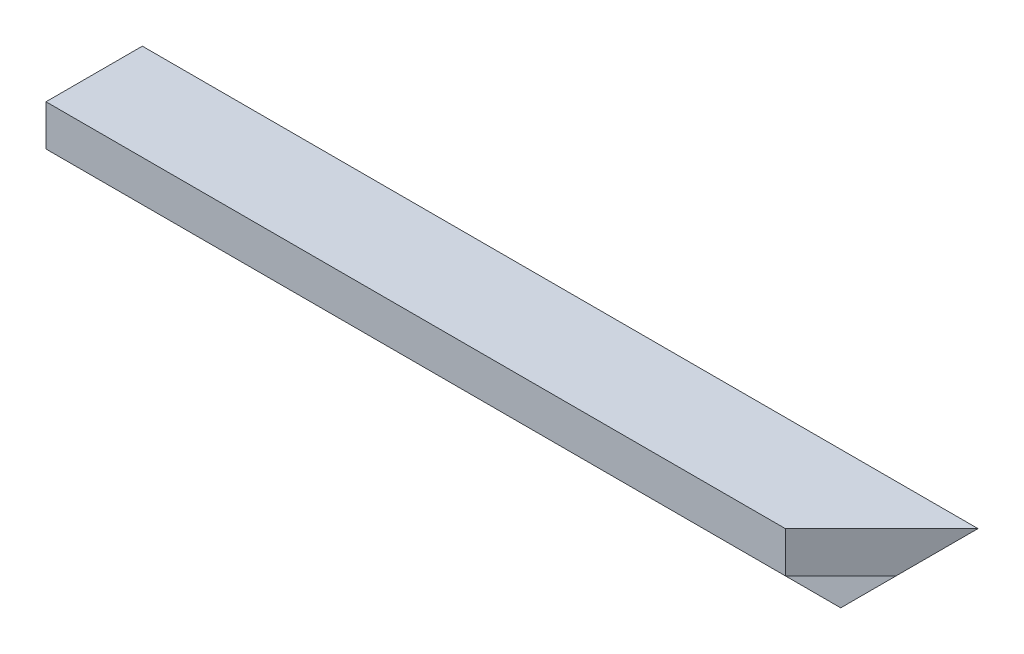
ISO-10303-21;
HEADER;
FILE_DESCRIPTION(('STEP AP214'),'2;1');
FILE_NAME('part.step','',(''),(''),'','','');
FILE_SCHEMA(('AUTOMOTIVE_DESIGN { 1 0 10303 214 1 1 1 1 }'));
ENDSEC;
DATA;
#1=APPLICATION_CONTEXT('core data for automotive mechanical design processes');
#2=APPLICATION_PROTOCOL_DEFINITION('international standard','automotive_design',2000,#1);
#3=PRODUCT_CONTEXT('',#1,'mechanical');
#4=PRODUCT('Part','Part','',(#3));
#5=PRODUCT_RELATED_PRODUCT_CATEGORY('part','',(#4));
#6=PRODUCT_DEFINITION_FORMATION('','',#4);
#7=PRODUCT_DEFINITION_CONTEXT('part definition',#1,'design');
#8=PRODUCT_DEFINITION('design','',#6,#7);
#9=PRODUCT_DEFINITION_SHAPE('','',#8);
#10=(LENGTH_UNIT() NAMED_UNIT(*) SI_UNIT(.MILLI.,.METRE.));
#11=(NAMED_UNIT(*) PLANE_ANGLE_UNIT() SI_UNIT($,.RADIAN.));
#12=(NAMED_UNIT(*) SI_UNIT($,.STERADIAN.) SOLID_ANGLE_UNIT());
#13=UNCERTAINTY_MEASURE_WITH_UNIT(LENGTH_MEASURE(1.E-05),#10,'distance_accuracy_value','');
#14=(GEOMETRIC_REPRESENTATION_CONTEXT(3) GLOBAL_UNCERTAINTY_ASSIGNED_CONTEXT((#13)) GLOBAL_UNIT_ASSIGNED_CONTEXT((#10,
#11,#12)) REPRESENTATION_CONTEXT('',''));
#15=CARTESIAN_POINT('',(0.,0.,0.));
#16=DIRECTION('',(0.,0.,1.));
#17=DIRECTION('',(1.,0.,0.));
#18=AXIS2_PLACEMENT_3D('',#15,#16,#17);
#19=CARTESIAN_POINT('',(222.000000000001,-40.,0.));
#20=DIRECTION('',(0.,0.,1.));
#21=DIRECTION('',(1.,0.,0.));
#22=AXIS2_PLACEMENT_3D('',#19,#20,#21);
#23=PLANE('',#22);
#24=DIRECTION('',(-1.,0.,0.));
#25=VECTOR('',#24,1.);
#26=CARTESIAN_POINT('',(222.000000000001,0.,0.));
#27=LINE('',#26,#25);
#28=CARTESIAN_POINT('',(222.,0.,0.));
#29=VERTEX_POINT('',#28);
#30=CARTESIAN_POINT('',(-125.,0.,0.));
#31=VERTEX_POINT('',#30);
#32=EDGE_CURVE('E40',#29,#31,#27,.T.);
#33=ORIENTED_EDGE('',*,*,#32,.F.);
#34=DIRECTION('',(0.707106781186548,0.707106781186547,0.));
#35=VECTOR('',#34,1.);
#36=CARTESIAN_POINT('',(222.,0.,0.));
#37=LINE('',#36,#35);
#38=CARTESIAN_POINT('',(182.,-40.,0.));
#39=VERTEX_POINT('',#38);
#40=EDGE_CURVE('E88',#39,#29,#37,.T.);
#41=ORIENTED_EDGE('',*,*,#40,.F.);
#42=DIRECTION('',(-1.,0.,0.));
#43=VECTOR('',#42,1.);
#44=CARTESIAN_POINT('',(222.000000000001,-40.,0.));
#45=LINE('',#44,#43);
#46=CARTESIAN_POINT('',(-125.,-40.,0.));
#47=VERTEX_POINT('',#46);
#48=EDGE_CURVE('E47',#39,#47,#45,.T.);
#49=ORIENTED_EDGE('',*,*,#48,.T.);
#50=DIRECTION('',(0.,1.,0.));
#51=VECTOR('',#50,1.);
#52=CARTESIAN_POINT('',(-125.,-40.,0.));
#53=LINE('',#52,#51);
#54=EDGE_CURVE('E118',#47,#31,#53,.T.);
#55=ORIENTED_EDGE('',*,*,#54,.T.);
#56=EDGE_LOOP('',(#33,#41,#49,#55));
#57=FACE_BOUND('',#56,.T.);
#58=ADVANCED_FACE('F33',(#57),#23,.F.);
#59=CARTESIAN_POINT('',(222.000000000001,0.,0.));
#60=DIRECTION('',(0.,-1.,0.));
#61=DIRECTION('',(0.,0.,-1.));
#62=AXIS2_PLACEMENT_3D('',#59,#60,#61);
#63=PLANE('',#62);
#64=DIRECTION('',(-1.,0.,0.));
#65=VECTOR('',#64,1.);
#66=CARTESIAN_POINT('',(222.000000000001,0.,40.));
#67=LINE('',#66,#65);
#68=CARTESIAN_POINT('',(182.,0.,40.));
#69=VERTEX_POINT('',#68);
#70=CARTESIAN_POINT('',(-125.,0.,40.));
#71=VERTEX_POINT('',#70);
#72=EDGE_CURVE('E109',#69,#71,#67,.T.);
#73=ORIENTED_EDGE('',*,*,#72,.F.);
#74=DIRECTION('',(-0.707106781186548,0.,0.707106781186547));
#75=VECTOR('',#74,1.);
#76=CARTESIAN_POINT('',(222.,0.,0.));
#77=LINE('',#76,#75);
#78=EDGE_CURVE('E117',#29,#69,#77,.T.);
#79=ORIENTED_EDGE('',*,*,#78,.F.);
#80=ORIENTED_EDGE('',*,*,#32,.T.);
#81=DIRECTION('',(0.,0.,1.));
#82=VECTOR('',#81,1.);
#83=CARTESIAN_POINT('',(-125.,0.,0.));
#84=LINE('',#83,#82);
#85=EDGE_CURVE('E115',#31,#71,#84,.T.);
#86=ORIENTED_EDGE('',*,*,#85,.T.);
#87=EDGE_LOOP('',(#73,#79,#80,#86));
#88=FACE_BOUND('',#87,.T.);
#89=ADVANCED_FACE('F114',(#88),#63,.F.);
#90=CARTESIAN_POINT('',(222.000000000001,0.,40.));
#91=DIRECTION('',(0.,0.,-1.));
#92=DIRECTION('',(-1.,0.,0.));
#93=AXIS2_PLACEMENT_3D('',#90,#91,#92);
#94=PLANE('',#93);
#95=DIRECTION('',(-1.,0.,0.));
#96=VECTOR('',#95,1.);
#97=CARTESIAN_POINT('',(222.000000000001,-17.,40.));
#98=LINE('',#97,#96);
#99=CARTESIAN_POINT('',(182.,-17.,40.));
#100=VERTEX_POINT('',#99);
#101=CARTESIAN_POINT('',(-125.,-17.,40.));
#102=VERTEX_POINT('',#101);
#103=EDGE_CURVE('E107',#100,#102,#98,.T.);
#104=ORIENTED_EDGE('',*,*,#103,.F.);
#105=DIRECTION('',(0.,1.,0.));
#106=VECTOR('',#105,1.);
#107=CARTESIAN_POINT('',(182.,-40.,40.));
#108=LINE('',#107,#106);
#109=EDGE_CURVE('E125',#100,#69,#108,.T.);
#110=ORIENTED_EDGE('',*,*,#109,.T.);
#111=ORIENTED_EDGE('',*,*,#72,.T.);
#112=DIRECTION('',(0.,-1.,0.));
#113=VECTOR('',#112,1.);
#114=CARTESIAN_POINT('',(-125.,0.,40.));
#115=LINE('',#114,#113);
#116=EDGE_CURVE('E122',#71,#102,#115,.T.);
#117=ORIENTED_EDGE('',*,*,#116,.T.);
#118=EDGE_LOOP('',(#104,#110,#111,#117));
#119=FACE_BOUND('',#118,.T.);
#120=ADVANCED_FACE('F153',(#119),#94,.F.);
#121=CARTESIAN_POINT('',(222.000000000001,-17.,40.));
#122=DIRECTION('',(0.,1.,0.));
#123=DIRECTION('',(0.,0.,1.));
#124=AXIS2_PLACEMENT_3D('',#121,#122,#123);
#125=PLANE('',#124);
#126=DIRECTION('',(-1.,0.,0.));
#127=VECTOR('',#126,1.);
#128=CARTESIAN_POINT('',(222.000000000001,-17.,17.));
#129=LINE('',#128,#127);
#130=CARTESIAN_POINT('',(205.,-17.,17.));
#131=VERTEX_POINT('',#130);
#132=CARTESIAN_POINT('',(-125.,-17.,17.));
#133=VERTEX_POINT('',#132);
#134=EDGE_CURVE('E100',#131,#133,#129,.T.);
#135=ORIENTED_EDGE('',*,*,#134,.F.);
#136=DIRECTION('',(-0.707106781186548,0.,0.707106781186548));
#137=VECTOR('',#136,1.);
#138=CARTESIAN_POINT('',(202.000000000001,-17.,19.9999999999993));
#139=LINE('',#138,#137);
#140=EDGE_CURVE('E120',#131,#100,#139,.T.);
#141=ORIENTED_EDGE('',*,*,#140,.T.);
#142=ORIENTED_EDGE('',*,*,#103,.T.);
#143=DIRECTION('',(0.,0.,-1.));
#144=VECTOR('',#143,1.);
#145=CARTESIAN_POINT('',(-125.,-17.,40.));
#146=LINE('',#145,#144);
#147=EDGE_CURVE('E131',#102,#133,#146,.T.);
#148=ORIENTED_EDGE('',*,*,#147,.T.);
#149=EDGE_LOOP('',(#135,#141,#142,#148));
#150=FACE_BOUND('',#149,.T.);
#151=ADVANCED_FACE('F157',(#150),#125,.F.);
#152=CARTESIAN_POINT('',(222.000000000001,-17.,17.));
#153=DIRECTION('',(0.,0.,-1.));
#154=DIRECTION('',(0.,1.,0.));
#155=AXIS2_PLACEMENT_3D('',#152,#153,#154);
#156=PLANE('',#155);
#157=DIRECTION('',(-1.,0.,0.));
#158=VECTOR('',#157,1.);
#159=CARTESIAN_POINT('',(222.000000000001,-40.,17.));
#160=LINE('',#159,#158);
#161=CARTESIAN_POINT('',(182.,-40.,17.));
#162=VERTEX_POINT('',#161);
#163=CARTESIAN_POINT('',(-125.,-40.,17.));
#164=VERTEX_POINT('',#163);
#165=EDGE_CURVE('E54',#162,#164,#160,.T.);
#166=ORIENTED_EDGE('',*,*,#165,.F.);
#167=DIRECTION('',(0.707106781186548,0.707106781186547,0.));
#168=VECTOR('',#167,1.);
#169=CARTESIAN_POINT('',(213.500000000001,-8.49999999999933,17.));
#170=LINE('',#169,#168);
#171=EDGE_CURVE('E90',#162,#131,#170,.T.);
#172=ORIENTED_EDGE('',*,*,#171,.T.);
#173=ORIENTED_EDGE('',*,*,#134,.T.);
#174=DIRECTION('',(0.,-1.,0.));
#175=VECTOR('',#174,1.);
#176=CARTESIAN_POINT('',(-125.,-17.,17.));
#177=LINE('',#176,#175);
#178=EDGE_CURVE('E102',#133,#164,#177,.T.);
#179=ORIENTED_EDGE('',*,*,#178,.T.);
#180=EDGE_LOOP('',(#166,#172,#173,#179));
#181=FACE_BOUND('',#180,.T.);
#182=ADVANCED_FACE('F135',(#181),#156,.F.);
#183=CARTESIAN_POINT('',(222.000000000001,-40.,17.));
#184=DIRECTION('',(0.,1.,0.));
#185=DIRECTION('',(0.,0.,1.));
#186=AXIS2_PLACEMENT_3D('',#183,#184,#185);
#187=PLANE('',#186);
#188=ORIENTED_EDGE('',*,*,#48,.F.);
#189=DIRECTION('',(0.,0.,-1.));
#190=VECTOR('',#189,1.);
#191=CARTESIAN_POINT('',(182.,-40.,40.));
#192=LINE('',#191,#190);
#193=EDGE_CURVE('E86',#162,#39,#192,.T.);
#194=ORIENTED_EDGE('',*,*,#193,.F.);
#195=ORIENTED_EDGE('',*,*,#165,.T.);
#196=DIRECTION('',(0.,0.,-1.));
#197=VECTOR('',#196,1.);
#198=CARTESIAN_POINT('',(-125.,-40.,17.));
#199=LINE('',#198,#197);
#200=EDGE_CURVE('E97',#164,#47,#199,.T.);
#201=ORIENTED_EDGE('',*,*,#200,.T.);
#202=EDGE_LOOP('',(#188,#194,#195,#201));
#203=FACE_BOUND('',#202,.T.);
#204=ADVANCED_FACE('F95',(#203),#187,.F.);
#205=CARTESIAN_POINT('',(-125.,0.,0.));
#206=DIRECTION('',(1.,0.,0.));
#207=DIRECTION('',(0.,0.,-1.));
#208=AXIS2_PLACEMENT_3D('',#205,#206,#207);
#209=PLANE('',#208);
#210=ORIENTED_EDGE('',*,*,#54,.F.);
#211=ORIENTED_EDGE('',*,*,#200,.F.);
#212=ORIENTED_EDGE('',*,*,#178,.F.);
#213=ORIENTED_EDGE('',*,*,#147,.F.);
#214=ORIENTED_EDGE('',*,*,#116,.F.);
#215=ORIENTED_EDGE('',*,*,#85,.F.);
#216=EDGE_LOOP('',(#210,#211,#212,#213,#214,#215));
#217=FACE_BOUND('',#216,.T.);
#218=ADVANCED_FACE('F138',(#217),#209,.F.);
#219=CARTESIAN_POINT('',(222.,-40.,0.));
#220=DIRECTION('',(-0.707106781186548,0.,-0.707106781186548));
#221=DIRECTION('',(-0.707106781186548,0.,0.707106781186548));
#222=AXIS2_PLACEMENT_3D('',#219,#220,#221);
#223=PLANE('',#222);
#224=ORIENTED_EDGE('',*,*,#140,.F.);
#225=DIRECTION('',(0.577350269189626,0.577350269189626,-0.577350269189626));
#226=VECTOR('',#225,1.);
#227=CARTESIAN_POINT('',(208.666666666667,-13.3333333333333,13.3333333333333));
#228=LINE('',#227,#226);
#229=EDGE_CURVE('E11',#131,#29,#228,.T.);
#230=ORIENTED_EDGE('',*,*,#229,.T.);
#231=ORIENTED_EDGE('',*,*,#78,.T.);
#232=ORIENTED_EDGE('',*,*,#109,.F.);
#233=EDGE_LOOP('',(#224,#230,#231,#232));
#234=FACE_BOUND('',#233,.T.);
#235=ADVANCED_FACE('F140',(#234),#223,.F.);
#236=CARTESIAN_POINT('',(222.,0.,40.));
#237=DIRECTION('',(-0.707106781186547,0.707106781186548,0.));
#238=DIRECTION('',(-0.707106781186548,-0.707106781186547,0.));
#239=AXIS2_PLACEMENT_3D('',#236,#237,#238);
#240=PLANE('',#239);
#241=ORIENTED_EDGE('',*,*,#193,.T.);
#242=ORIENTED_EDGE('',*,*,#40,.T.);
#243=ORIENTED_EDGE('',*,*,#229,.F.);
#244=ORIENTED_EDGE('',*,*,#171,.F.);
#245=EDGE_LOOP('',(#241,#242,#243,#244));
#246=FACE_BOUND('',#245,.T.);
#247=ADVANCED_FACE('F87',(#246),#240,.F.);
#248=CLOSED_SHELL('',(#58,#89,#120,#151,#182,#204,#218,#235,#247));
#249=MANIFOLD_SOLID_BREP('B2',#248);
#250=ADVANCED_BREP_SHAPE_REPRESENTATION('',(#18,#249),#14);
#251=SHAPE_DEFINITION_REPRESENTATION(#9,#250);
ENDSEC;
END-ISO-10303-21;
